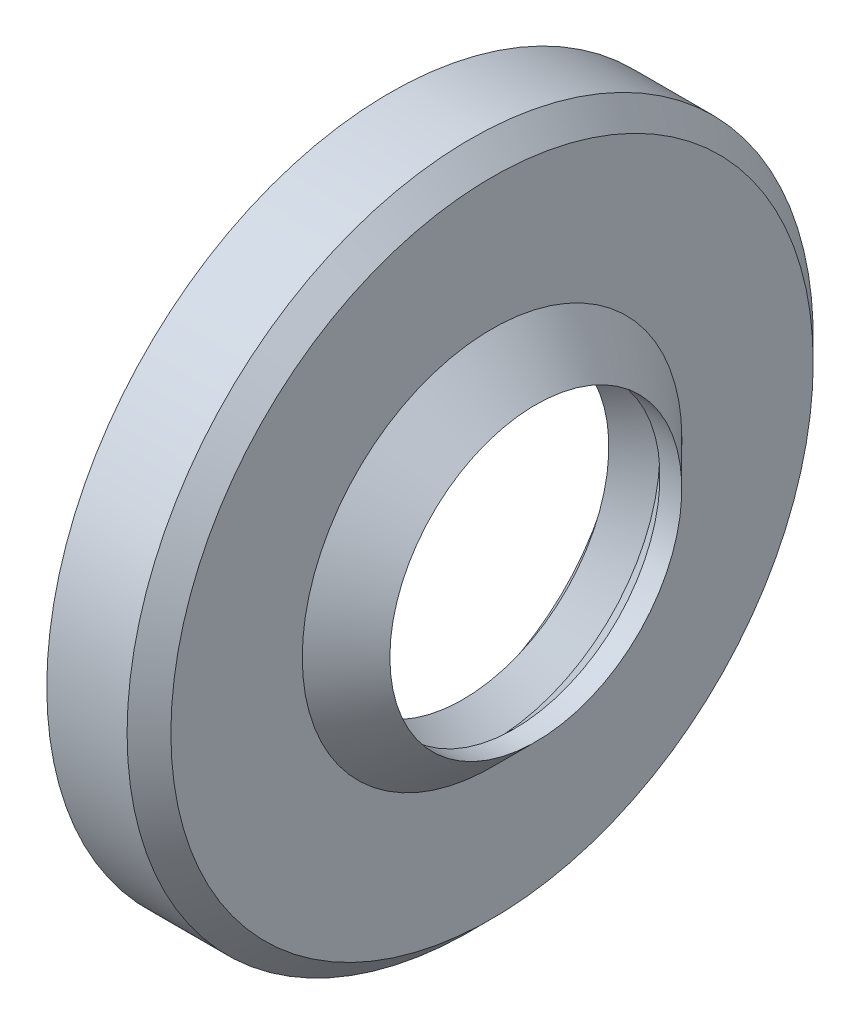
ISO-10303-21;
HEADER;
FILE_DESCRIPTION(('STEP AP214'),'2;1');
FILE_NAME('part.step','',(''),(''),'','','');
FILE_SCHEMA(('AUTOMOTIVE_DESIGN { 1 0 10303 214 1 1 1 1 }'));
ENDSEC;
DATA;
#1=APPLICATION_CONTEXT('core data for automotive mechanical design processes');
#2=APPLICATION_PROTOCOL_DEFINITION('international standard','automotive_design',2000,#1);
#3=PRODUCT_CONTEXT('',#1,'mechanical');
#4=PRODUCT('Part','Part','',(#3));
#5=PRODUCT_RELATED_PRODUCT_CATEGORY('part','',(#4));
#6=PRODUCT_DEFINITION_FORMATION('','',#4);
#7=PRODUCT_DEFINITION_CONTEXT('part definition',#1,'design');
#8=PRODUCT_DEFINITION('design','',#6,#7);
#9=PRODUCT_DEFINITION_SHAPE('','',#8);
#10=(LENGTH_UNIT() NAMED_UNIT(*) SI_UNIT(.MILLI.,.METRE.));
#11=(NAMED_UNIT(*) PLANE_ANGLE_UNIT() SI_UNIT($,.RADIAN.));
#12=(NAMED_UNIT(*) SI_UNIT($,.STERADIAN.) SOLID_ANGLE_UNIT());
#13=UNCERTAINTY_MEASURE_WITH_UNIT(LENGTH_MEASURE(1.E-05),#10,'distance_accuracy_value','');
#14=(GEOMETRIC_REPRESENTATION_CONTEXT(3) GLOBAL_UNCERTAINTY_ASSIGNED_CONTEXT((#13)) GLOBAL_UNIT_ASSIGNED_CONTEXT((#10,
#11,#12)) REPRESENTATION_CONTEXT('',''));
#15=CARTESIAN_POINT('',(0.,0.,0.));
#16=DIRECTION('',(0.,0.,1.));
#17=DIRECTION('',(1.,0.,0.));
#18=AXIS2_PLACEMENT_3D('',#15,#16,#17);
#19=CARTESIAN_POINT('',(-1000.,0.,0.));
#20=DIRECTION('',(-1.,0.,0.));
#21=DIRECTION('',(0.,0.,1.));
#22=AXIS2_PLACEMENT_3D('',#19,#20,#21);
#23=CYLINDRICAL_SURFACE('',#22,22.);
#24=CARTESIAN_POINT('',(5.50000000000006,0.,0.));
#25=DIRECTION('',(-1.,0.,0.));
#26=DIRECTION('',(0.,0.,1.));
#27=AXIS2_PLACEMENT_3D('',#24,#25,#26);
#28=CIRCLE('',#27,22.);
#29=CARTESIAN_POINT('',(5.50000000000006,0.,22.));
#30=VERTEX_POINT('',#29);
#31=EDGE_CURVE('E76',#30,#30,#28,.T.);
#32=ORIENTED_EDGE('',*,*,#31,.F.);
#33=EDGE_LOOP('',(#32));
#34=FACE_BOUND('',#33,.T.);
#35=CARTESIAN_POINT('',(0.,0.,0.));
#36=DIRECTION('',(-1.,0.,0.));
#37=DIRECTION('',(0.,0.,1.));
#38=AXIS2_PLACEMENT_3D('',#35,#36,#37);
#39=CIRCLE('',#38,22.);
#40=CARTESIAN_POINT('',(0.,0.,22.));
#41=VERTEX_POINT('',#40);
#42=EDGE_CURVE('E10',#41,#41,#39,.T.);
#43=ORIENTED_EDGE('',*,*,#42,.T.);
#44=EDGE_LOOP('',(#43));
#45=FACE_BOUND('',#44,.T.);
#46=ADVANCED_FACE('F33',(#34,#45),#23,.F.);
#47=CARTESIAN_POINT('',(0.,22.,0.));
#48=DIRECTION('',(1.,0.,0.));
#49=DIRECTION('',(0.,0.,-1.));
#50=AXIS2_PLACEMENT_3D('',#47,#48,#49);
#51=PLANE('',#50);
#52=ORIENTED_EDGE('',*,*,#42,.F.);
#53=EDGE_LOOP('',(#52));
#54=FACE_BOUND('',#53,.T.);
#55=CARTESIAN_POINT('',(0.,0.,0.));
#56=DIRECTION('',(-1.,0.,0.));
#57=DIRECTION('',(0.,0.,1.));
#58=AXIS2_PLACEMENT_3D('',#55,#56,#57);
#59=CIRCLE('',#58,23.5);
#60=CARTESIAN_POINT('',(0.,0.,23.5));
#61=VERTEX_POINT('',#60);
#62=EDGE_CURVE('E39',#61,#61,#59,.T.);
#63=ORIENTED_EDGE('',*,*,#62,.T.);
#64=EDGE_LOOP('',(#63));
#65=FACE_BOUND('',#64,.T.);
#66=ADVANCED_FACE('F83',(#54,#65),#51,.F.);
#67=CARTESIAN_POINT('',(-1000.,0.,0.));
#68=DIRECTION('',(-1.,0.,0.));
#69=DIRECTION('',(0.,0.,1.));
#70=AXIS2_PLACEMENT_3D('',#67,#68,#69);
#71=CYLINDRICAL_SURFACE('',#70,23.5);
#72=ORIENTED_EDGE('',*,*,#62,.F.);
#73=EDGE_LOOP('',(#72));
#74=FACE_BOUND('',#73,.T.);
#75=CARTESIAN_POINT('',(5.50000000000006,0.,0.));
#76=DIRECTION('',(-1.,0.,0.));
#77=DIRECTION('',(0.,0.,1.));
#78=AXIS2_PLACEMENT_3D('',#75,#76,#77);
#79=CIRCLE('',#78,23.5);
#80=CARTESIAN_POINT('',(5.50000000000006,0.,23.5));
#81=VERTEX_POINT('',#80);
#82=EDGE_CURVE('E43',#81,#81,#79,.T.);
#83=ORIENTED_EDGE('',*,*,#82,.T.);
#84=EDGE_LOOP('',(#83));
#85=FACE_BOUND('',#84,.T.);
#86=ADVANCED_FACE('F87',(#74,#85),#71,.T.);
#87=CARTESIAN_POINT('',(6.9999999999999,0.,0.));
#88=DIRECTION('',(-1.,0.,0.));
#89=DIRECTION('',(0.,0.,1.));
#90=AXIS2_PLACEMENT_3D('',#87,#88,#89);
#91=CONICAL_SURFACE('',#90,22.,0.785398163397503);
#92=ORIENTED_EDGE('',*,*,#82,.F.);
#93=EDGE_LOOP('',(#92));
#94=FACE_BOUND('',#93,.T.);
#95=CARTESIAN_POINT('',(6.9999999999999,0.,0.));
#96=DIRECTION('',(-1.,0.,0.));
#97=DIRECTION('',(0.,0.,1.));
#98=AXIS2_PLACEMENT_3D('',#95,#96,#97);
#99=CIRCLE('',#98,22.);
#100=CARTESIAN_POINT('',(6.9999999999999,0.,22.));
#101=VERTEX_POINT('',#100);
#102=EDGE_CURVE('E47',#101,#101,#99,.T.);
#103=ORIENTED_EDGE('',*,*,#102,.T.);
#104=EDGE_LOOP('',(#103));
#105=FACE_BOUND('',#104,.T.);
#106=ADVANCED_FACE('F92',(#94,#105),#91,.T.);
#107=CARTESIAN_POINT('',(7.,22.,0.));
#108=DIRECTION('',(-1.,0.,0.));
#109=DIRECTION('',(0.,0.,1.));
#110=AXIS2_PLACEMENT_3D('',#107,#108,#109);
#111=PLANE('',#110);
#112=ORIENTED_EDGE('',*,*,#102,.F.);
#113=EDGE_LOOP('',(#112));
#114=FACE_BOUND('',#113,.T.);
#115=CARTESIAN_POINT('',(6.9999999999999,0.,0.));
#116=DIRECTION('',(-1.,0.,0.));
#117=DIRECTION('',(0.,0.,1.));
#118=AXIS2_PLACEMENT_3D('',#115,#116,#117);
#119=CIRCLE('',#118,13.);
#120=CARTESIAN_POINT('',(6.9999999999999,0.,13.));
#121=VERTEX_POINT('',#120);
#122=EDGE_CURVE('E52',#121,#121,#119,.T.);
#123=ORIENTED_EDGE('',*,*,#122,.T.);
#124=EDGE_LOOP('',(#123));
#125=FACE_BOUND('',#124,.T.);
#126=ADVANCED_FACE('F98',(#114,#125),#111,.F.);
#127=CARTESIAN_POINT('',(10.,0.,0.));
#128=DIRECTION('',(-1.,0.,0.));
#129=DIRECTION('',(0.,0.,1.));
#130=AXIS2_PLACEMENT_3D('',#127,#128,#129);
#131=CONICAL_SURFACE('',#130,10.,0.785398163397428);
#132=ORIENTED_EDGE('',*,*,#122,.F.);
#133=EDGE_LOOP('',(#132));
#134=FACE_BOUND('',#133,.T.);
#135=CARTESIAN_POINT('',(10.,0.,0.));
#136=DIRECTION('',(-1.,0.,0.));
#137=DIRECTION('',(0.,0.,1.));
#138=AXIS2_PLACEMENT_3D('',#135,#136,#137);
#139=CIRCLE('',#138,10.);
#140=CARTESIAN_POINT('',(10.,0.,10.));
#141=VERTEX_POINT('',#140);
#142=EDGE_CURVE('E55',#141,#141,#139,.T.);
#143=ORIENTED_EDGE('',*,*,#142,.T.);
#144=EDGE_LOOP('',(#143));
#145=FACE_BOUND('',#144,.T.);
#146=ADVANCED_FACE('F102',(#134,#145),#131,.T.);
#147=CARTESIAN_POINT('',(-1000.,0.,0.));
#148=DIRECTION('',(-1.,0.,0.));
#149=DIRECTION('',(0.,0.,1.));
#150=AXIS2_PLACEMENT_3D('',#147,#148,#149);
#151=CYLINDRICAL_SURFACE('',#150,10.);
#152=ORIENTED_EDGE('',*,*,#142,.F.);
#153=EDGE_LOOP('',(#152));
#154=FACE_BOUND('',#153,.T.);
#155=CARTESIAN_POINT('',(8.49999999999995,0.,0.));
#156=DIRECTION('',(-1.,0.,0.));
#157=DIRECTION('',(0.,0.,1.));
#158=AXIS2_PLACEMENT_3D('',#155,#156,#157);
#159=CIRCLE('',#158,10.);
#160=CARTESIAN_POINT('',(8.49999999999995,0.,10.));
#161=VERTEX_POINT('',#160);
#162=EDGE_CURVE('E58',#161,#161,#159,.T.);
#163=ORIENTED_EDGE('',*,*,#162,.T.);
#164=EDGE_LOOP('',(#163));
#165=FACE_BOUND('',#164,.T.);
#166=ADVANCED_FACE('F106',(#154,#165),#151,.F.);
#167=CARTESIAN_POINT('',(6.9999999999999,0.,0.));
#168=DIRECTION('',(-1.,0.,0.));
#169=DIRECTION('',(0.,0.,1.));
#170=AXIS2_PLACEMENT_3D('',#167,#168,#169);
#171=CONICAL_SURFACE('',#170,11.5,0.785398163397427);
#172=ORIENTED_EDGE('',*,*,#162,.F.);
#173=EDGE_LOOP('',(#172));
#174=FACE_BOUND('',#173,.T.);
#175=CARTESIAN_POINT('',(6.9999999999999,0.,0.));
#176=DIRECTION('',(-1.,0.,0.));
#177=DIRECTION('',(0.,0.,1.));
#178=AXIS2_PLACEMENT_3D('',#175,#176,#177);
#179=CIRCLE('',#178,11.5);
#180=CARTESIAN_POINT('',(6.9999999999999,0.,11.5));
#181=VERTEX_POINT('',#180);
#182=EDGE_CURVE('E61',#181,#181,#179,.T.);
#183=ORIENTED_EDGE('',*,*,#182,.T.);
#184=EDGE_LOOP('',(#183));
#185=FACE_BOUND('',#184,.T.);
#186=ADVANCED_FACE('F110',(#174,#185),#171,.F.);
#187=CARTESIAN_POINT('',(5.00000000000012,0.,0.));
#188=DIRECTION('',(1.,0.,0.));
#189=DIRECTION('',(0.,0.,-1.));
#190=AXIS2_PLACEMENT_3D('',#187,#188,#189);
#191=CONICAL_SURFACE('',#190,10.,0.643501108793335);
#192=ORIENTED_EDGE('',*,*,#182,.F.);
#193=EDGE_LOOP('',(#192));
#194=FACE_BOUND('',#193,.T.);
#195=CARTESIAN_POINT('',(5.00000000000012,0.,0.));
#196=DIRECTION('',(-1.,0.,0.));
#197=DIRECTION('',(0.,0.,1.));
#198=AXIS2_PLACEMENT_3D('',#195,#196,#197);
#199=CIRCLE('',#198,10.);
#200=CARTESIAN_POINT('',(5.00000000000012,0.,10.));
#201=VERTEX_POINT('',#200);
#202=EDGE_CURVE('E64',#201,#201,#199,.T.);
#203=ORIENTED_EDGE('',*,*,#202,.T.);
#204=EDGE_LOOP('',(#203));
#205=FACE_BOUND('',#204,.T.);
#206=ADVANCED_FACE('F114',(#194,#205),#191,.F.);
#207=CARTESIAN_POINT('',(2.75000000000003,0.,0.));
#208=DIRECTION('',(-1.,0.,0.));
#209=DIRECTION('',(0.,0.,1.));
#210=AXIS2_PLACEMENT_3D('',#207,#208,#209);
#211=CONICAL_SURFACE('',#210,13.,0.927295218001593);
#212=ORIENTED_EDGE('',*,*,#202,.F.);
#213=EDGE_LOOP('',(#212));
#214=FACE_BOUND('',#213,.T.);
#215=CARTESIAN_POINT('',(2.75000000000003,0.,0.));
#216=DIRECTION('',(-1.,0.,0.));
#217=DIRECTION('',(0.,0.,1.));
#218=AXIS2_PLACEMENT_3D('',#215,#216,#217);
#219=CIRCLE('',#218,13.);
#220=CARTESIAN_POINT('',(2.75000000000003,0.,13.));
#221=VERTEX_POINT('',#220);
#222=EDGE_CURVE('E67',#221,#221,#219,.T.);
#223=ORIENTED_EDGE('',*,*,#222,.T.);
#224=EDGE_LOOP('',(#223));
#225=FACE_BOUND('',#224,.T.);
#226=ADVANCED_FACE('F118',(#214,#225),#211,.F.);
#227=CARTESIAN_POINT('',(2.75,13.,0.));
#228=DIRECTION('',(1.,0.,0.));
#229=DIRECTION('',(0.,0.,-1.));
#230=AXIS2_PLACEMENT_3D('',#227,#228,#229);
#231=PLANE('',#230);
#232=ORIENTED_EDGE('',*,*,#222,.F.);
#233=EDGE_LOOP('',(#232));
#234=FACE_BOUND('',#233,.T.);
#235=CARTESIAN_POINT('',(2.75000000000003,0.,0.));
#236=DIRECTION('',(-1.,0.,0.));
#237=DIRECTION('',(0.,0.,1.));
#238=AXIS2_PLACEMENT_3D('',#235,#236,#237);
#239=CIRCLE('',#238,14.5);
#240=CARTESIAN_POINT('',(2.75000000000003,0.,14.5));
#241=VERTEX_POINT('',#240);
#242=EDGE_CURVE('E70',#241,#241,#239,.T.);
#243=ORIENTED_EDGE('',*,*,#242,.T.);
#244=EDGE_LOOP('',(#243));
#245=FACE_BOUND('',#244,.T.);
#246=ADVANCED_FACE('F122',(#234,#245),#231,.F.);
#247=CARTESIAN_POINT('',(-1000.,0.,0.));
#248=DIRECTION('',(-1.,0.,0.));
#249=DIRECTION('',(0.,0.,1.));
#250=AXIS2_PLACEMENT_3D('',#247,#248,#249);
#251=CYLINDRICAL_SURFACE('',#250,14.5);
#252=ORIENTED_EDGE('',*,*,#242,.F.);
#253=EDGE_LOOP('',(#252));
#254=FACE_BOUND('',#253,.T.);
#255=CARTESIAN_POINT('',(5.50000000000006,0.,0.));
#256=DIRECTION('',(-1.,0.,0.));
#257=DIRECTION('',(0.,0.,1.));
#258=AXIS2_PLACEMENT_3D('',#255,#256,#257);
#259=CIRCLE('',#258,14.5);
#260=CARTESIAN_POINT('',(5.50000000000006,0.,14.5));
#261=VERTEX_POINT('',#260);
#262=EDGE_CURVE('E73',#261,#261,#259,.T.);
#263=ORIENTED_EDGE('',*,*,#262,.T.);
#264=EDGE_LOOP('',(#263));
#265=FACE_BOUND('',#264,.T.);
#266=ADVANCED_FACE('F126',(#254,#265),#251,.T.);
#267=CARTESIAN_POINT('',(5.5,14.5,0.));
#268=DIRECTION('',(1.,0.,0.));
#269=DIRECTION('',(0.,0.,-1.));
#270=AXIS2_PLACEMENT_3D('',#267,#268,#269);
#271=PLANE('',#270);
#272=ORIENTED_EDGE('',*,*,#262,.F.);
#273=EDGE_LOOP('',(#272));
#274=FACE_BOUND('',#273,.T.);
#275=ORIENTED_EDGE('',*,*,#31,.T.);
#276=EDGE_LOOP('',(#275));
#277=FACE_BOUND('',#276,.T.);
#278=ADVANCED_FACE('F80',(#274,#277),#271,.F.);
#279=CLOSED_SHELL('',(#46,#66,#86,#106,#126,#146,#166,#186,#206,#226,#246,#266,#278));
#280=MANIFOLD_SOLID_BREP('B2',#279);
#281=ADVANCED_BREP_SHAPE_REPRESENTATION('',(#18,#280),#14);
#282=SHAPE_DEFINITION_REPRESENTATION(#9,#281);
ENDSEC;
END-ISO-10303-21;
